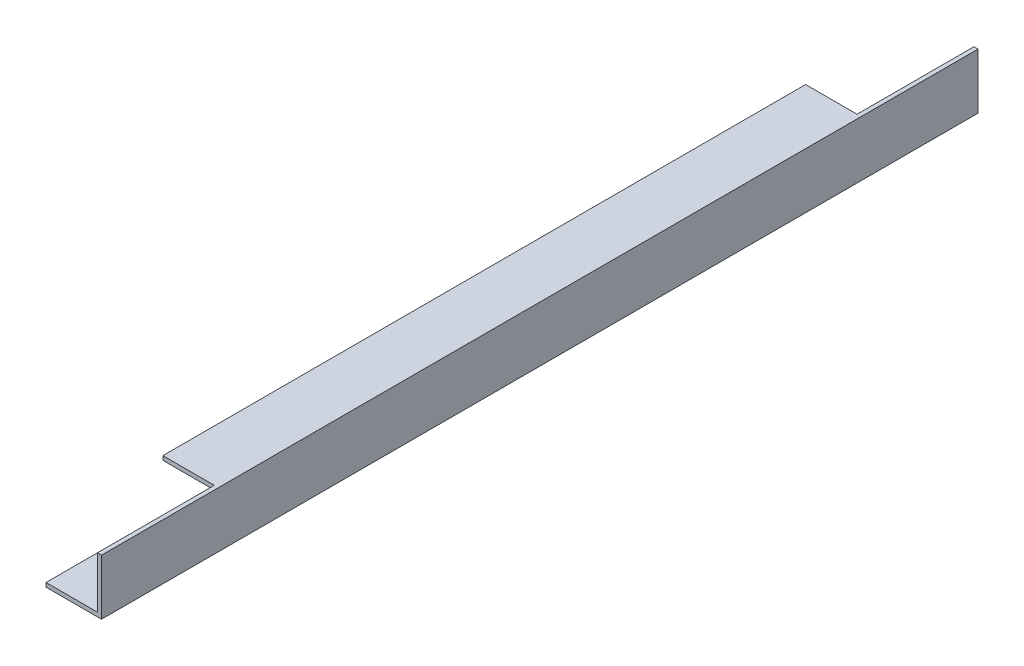
ISO-10303-21;
HEADER;
FILE_DESCRIPTION(('STEP AP214'),'2;1');
FILE_NAME('part.step','',(''),(''),'','','');
FILE_SCHEMA(('AUTOMOTIVE_DESIGN { 1 0 10303 214 1 1 1 1 }'));
ENDSEC;
DATA;
#1=APPLICATION_CONTEXT('core data for automotive mechanical design processes');
#2=APPLICATION_PROTOCOL_DEFINITION('international standard','automotive_design',2000,#1);
#3=PRODUCT_CONTEXT('',#1,'mechanical');
#4=PRODUCT('Part','Part','',(#3));
#5=PRODUCT_RELATED_PRODUCT_CATEGORY('part','',(#4));
#6=PRODUCT_DEFINITION_FORMATION('','',#4);
#7=PRODUCT_DEFINITION_CONTEXT('part definition',#1,'design');
#8=PRODUCT_DEFINITION('design','',#6,#7);
#9=PRODUCT_DEFINITION_SHAPE('','',#8);
#10=(LENGTH_UNIT() NAMED_UNIT(*) SI_UNIT(.MILLI.,.METRE.));
#11=(NAMED_UNIT(*) PLANE_ANGLE_UNIT() SI_UNIT($,.RADIAN.));
#12=(NAMED_UNIT(*) SI_UNIT($,.STERADIAN.) SOLID_ANGLE_UNIT());
#13=UNCERTAINTY_MEASURE_WITH_UNIT(LENGTH_MEASURE(1.E-05),#10,'distance_accuracy_value','');
#14=(GEOMETRIC_REPRESENTATION_CONTEXT(3) GLOBAL_UNCERTAINTY_ASSIGNED_CONTEXT((#13)) GLOBAL_UNIT_ASSIGNED_CONTEXT((#10,
#11,#12)) REPRESENTATION_CONTEXT('',''));
#15=CARTESIAN_POINT('',(0.,0.,0.));
#16=DIRECTION('',(0.,0.,1.));
#17=DIRECTION('',(1.,0.,0.));
#18=AXIS2_PLACEMENT_3D('',#15,#16,#17);
#19=CARTESIAN_POINT('',(4.75,4.75,75.));
#20=DIRECTION('',(0.,-1.,0.));
#21=DIRECTION('',(0.,0.,-1.));
#22=AXIS2_PLACEMENT_3D('',#19,#20,#21);
#23=PLANE('',#22);
#24=DIRECTION('',(0.,0.,1.));
#25=VECTOR('',#24,1.);
#26=CARTESIAN_POINT('',(4.05,4.75,75.));
#27=LINE('',#26,#25);
#28=CARTESIAN_POINT('',(4.05,4.75,55.));
#29=VERTEX_POINT('',#28);
#30=CARTESIAN_POINT('',(4.05,4.75,75.));
#31=VERTEX_POINT('',#30);
#32=EDGE_CURVE('E184',#29,#31,#27,.T.);
#33=ORIENTED_EDGE('',*,*,#32,.T.);
#34=DIRECTION('',(-1.,0.,0.));
#35=VECTOR('',#34,1.);
#36=CARTESIAN_POINT('',(4.75,4.75,75.));
#37=LINE('',#36,#35);
#38=CARTESIAN_POINT('',(4.75,4.75,75.));
#39=VERTEX_POINT('',#38);
#40=EDGE_CURVE('E132',#39,#31,#37,.T.);
#41=ORIENTED_EDGE('',*,*,#40,.F.);
#42=DIRECTION('',(0.,0.,-1.));
#43=VECTOR('',#42,1.);
#44=CARTESIAN_POINT('',(4.75,4.75,75.));
#45=LINE('',#44,#43);
#46=CARTESIAN_POINT('',(4.75,4.75,-75.));
#47=VERTEX_POINT('',#46);
#48=EDGE_CURVE('E117',#39,#47,#45,.T.);
#49=ORIENTED_EDGE('',*,*,#48,.T.);
#50=DIRECTION('',(-1.,0.,0.));
#51=VECTOR('',#50,1.);
#52=CARTESIAN_POINT('',(4.75,4.75,-75.));
#53=LINE('',#52,#51);
#54=CARTESIAN_POINT('',(4.05,4.75,-75.));
#55=VERTEX_POINT('',#54);
#56=EDGE_CURVE('E121',#47,#55,#53,.T.);
#57=ORIENTED_EDGE('',*,*,#56,.T.);
#58=DIRECTION('',(0.,0.,-1.));
#59=VECTOR('',#58,1.);
#60=CARTESIAN_POINT('',(4.05,4.75,-75.));
#61=LINE('',#60,#59);
#62=CARTESIAN_POINT('',(4.05,4.75,-55.));
#63=VERTEX_POINT('',#62);
#64=EDGE_CURVE('E169',#63,#55,#61,.T.);
#65=ORIENTED_EDGE('',*,*,#64,.F.);
#66=DIRECTION('',(1.,0.,0.));
#67=VECTOR('',#66,1.);
#68=CARTESIAN_POINT('',(-4.75,4.75,-55.));
#69=LINE('',#68,#67);
#70=CARTESIAN_POINT('',(-4.75,4.75,-55.));
#71=VERTEX_POINT('',#70);
#72=EDGE_CURVE('E172',#71,#63,#69,.T.);
#73=ORIENTED_EDGE('',*,*,#72,.F.);
#74=DIRECTION('',(0.,0.,-1.));
#75=VECTOR('',#74,1.);
#76=CARTESIAN_POINT('',(-4.75,4.75,75.));
#77=LINE('',#76,#75);
#78=CARTESIAN_POINT('',(-4.75,4.75,55.));
#79=VERTEX_POINT('',#78);
#80=EDGE_CURVE('E11',#79,#71,#77,.T.);
#81=ORIENTED_EDGE('',*,*,#80,.F.);
#82=DIRECTION('',(1.,0.,0.));
#83=VECTOR('',#82,1.);
#84=CARTESIAN_POINT('',(-4.75,4.75,55.));
#85=LINE('',#84,#83);
#86=EDGE_CURVE('E186',#79,#29,#85,.T.);
#87=ORIENTED_EDGE('',*,*,#86,.T.);
#88=EDGE_LOOP('',(#33,#41,#49,#57,#65,#73,#81,#87));
#89=FACE_BOUND('',#88,.T.);
#90=ADVANCED_FACE('F33',(#89),#23,.F.);
#91=CARTESIAN_POINT('',(-4.75,4.75,75.));
#92=DIRECTION('',(1.,0.,0.));
#93=DIRECTION('',(0.,0.,-1.));
#94=AXIS2_PLACEMENT_3D('',#91,#92,#93);
#95=PLANE('',#94);
#96=DIRECTION('',(0.,1.,0.));
#97=VECTOR('',#96,1.);
#98=CARTESIAN_POINT('',(-4.75,-17.8004004539963,55.));
#99=LINE('',#98,#97);
#100=CARTESIAN_POINT('',(-4.75,4.05,55.));
#101=VERTEX_POINT('',#100);
#102=EDGE_CURVE('E194',#101,#79,#99,.T.);
#103=ORIENTED_EDGE('',*,*,#102,.T.);
#104=ORIENTED_EDGE('',*,*,#80,.T.);
#105=DIRECTION('',(0.,1.,0.));
#106=VECTOR('',#105,1.);
#107=CARTESIAN_POINT('',(-4.75,-17.8004004539963,-55.));
#108=LINE('',#107,#106);
#109=CARTESIAN_POINT('',(-4.75,4.05,-55.));
#110=VERTEX_POINT('',#109);
#111=EDGE_CURVE('E162',#110,#71,#108,.T.);
#112=ORIENTED_EDGE('',*,*,#111,.F.);
#113=DIRECTION('',(0.,0.,-1.));
#114=VECTOR('',#113,1.);
#115=CARTESIAN_POINT('',(-4.75,4.05,75.));
#116=LINE('',#115,#114);
#117=EDGE_CURVE('E40',#101,#110,#116,.T.);
#118=ORIENTED_EDGE('',*,*,#117,.F.);
#119=EDGE_LOOP('',(#103,#104,#112,#118));
#120=FACE_BOUND('',#119,.T.);
#121=ADVANCED_FACE('F167',(#120),#95,.F.);
#122=CARTESIAN_POINT('',(4.05,4.05,75.));
#123=DIRECTION('',(0.,1.,0.));
#124=DIRECTION('',(-1.,0.,0.));
#125=AXIS2_PLACEMENT_3D('',#122,#123,#124);
#126=PLANE('',#125);
#127=DIRECTION('',(-1.,0.,0.));
#128=VECTOR('',#127,1.);
#129=CARTESIAN_POINT('',(-4.75,4.05,55.));
#130=LINE('',#129,#128);
#131=CARTESIAN_POINT('',(4.05,4.05,55.));
#132=VERTEX_POINT('',#131);
#133=EDGE_CURVE('E152',#132,#101,#130,.T.);
#134=ORIENTED_EDGE('',*,*,#133,.T.);
#135=ORIENTED_EDGE('',*,*,#117,.T.);
#136=DIRECTION('',(-1.,0.,0.));
#137=VECTOR('',#136,1.);
#138=CARTESIAN_POINT('',(-4.75,4.05,-55.));
#139=LINE('',#138,#137);
#140=CARTESIAN_POINT('',(4.05,4.05,-55.));
#141=VERTEX_POINT('',#140);
#142=EDGE_CURVE('E124',#141,#110,#139,.T.);
#143=ORIENTED_EDGE('',*,*,#142,.F.);
#144=DIRECTION('',(0.,0.,-1.));
#145=VECTOR('',#144,1.);
#146=CARTESIAN_POINT('',(4.05,4.05,75.));
#147=LINE('',#146,#145);
#148=EDGE_CURVE('E139',#132,#141,#147,.T.);
#149=ORIENTED_EDGE('',*,*,#148,.F.);
#150=EDGE_LOOP('',(#134,#135,#143,#149));
#151=FACE_BOUND('',#150,.T.);
#152=ADVANCED_FACE('F147',(#151),#126,.F.);
#153=CARTESIAN_POINT('',(0.,0.,75.));
#154=DIRECTION('',(0.,0.,1.));
#155=DIRECTION('',(1.,0.,0.));
#156=AXIS2_PLACEMENT_3D('',#153,#154,#155);
#157=PLANE('',#156);
#158=ORIENTED_EDGE('',*,*,#40,.T.);
#159=DIRECTION('',(0.,-1.,0.));
#160=VECTOR('',#159,1.);
#161=CARTESIAN_POINT('',(4.05,4.05,75.));
#162=LINE('',#161,#160);
#163=CARTESIAN_POINT('',(4.05,-4.05,75.));
#164=VERTEX_POINT('',#163);
#165=EDGE_CURVE('E86',#31,#164,#162,.T.);
#166=ORIENTED_EDGE('',*,*,#165,.T.);
#167=DIRECTION('',(-1.,0.,0.));
#168=VECTOR('',#167,1.);
#169=CARTESIAN_POINT('',(4.05,-4.05,75.));
#170=LINE('',#169,#168);
#171=CARTESIAN_POINT('',(-4.75,-4.05,75.));
#172=VERTEX_POINT('',#171);
#173=EDGE_CURVE('E100',#164,#172,#170,.T.);
#174=ORIENTED_EDGE('',*,*,#173,.T.);
#175=DIRECTION('',(0.,-1.,0.));
#176=VECTOR('',#175,1.);
#177=CARTESIAN_POINT('',(-4.75,-4.75,75.));
#178=LINE('',#177,#176);
#179=CARTESIAN_POINT('',(-4.75,-4.75,75.));
#180=VERTEX_POINT('',#179);
#181=EDGE_CURVE('E93',#172,#180,#178,.T.);
#182=ORIENTED_EDGE('',*,*,#181,.T.);
#183=DIRECTION('',(1.,0.,0.));
#184=VECTOR('',#183,1.);
#185=CARTESIAN_POINT('',(4.75,-4.75,75.));
#186=LINE('',#185,#184);
#187=CARTESIAN_POINT('',(4.75,-4.75,75.));
#188=VERTEX_POINT('',#187);
#189=EDGE_CURVE('E97',#180,#188,#186,.T.);
#190=ORIENTED_EDGE('',*,*,#189,.T.);
#191=DIRECTION('',(0.,1.,0.));
#192=VECTOR('',#191,1.);
#193=CARTESIAN_POINT('',(4.75,4.75,75.));
#194=LINE('',#193,#192);
#195=EDGE_CURVE('E56',#188,#39,#194,.T.);
#196=ORIENTED_EDGE('',*,*,#195,.T.);
#197=EDGE_LOOP('',(#158,#166,#174,#182,#190,#196));
#198=FACE_BOUND('',#197,.T.);
#199=ADVANCED_FACE('F95',(#198),#157,.T.);
#200=CARTESIAN_POINT('',(4.05,4.05,75.));
#201=DIRECTION('',(1.,0.,0.));
#202=DIRECTION('',(0.,1.,0.));
#203=AXIS2_PLACEMENT_3D('',#200,#201,#202);
#204=PLANE('',#203);
#205=DIRECTION('',(0.,-1.,0.));
#206=VECTOR('',#205,1.);
#207=CARTESIAN_POINT('',(4.05,4.05,-75.));
#208=LINE('',#207,#206);
#209=CARTESIAN_POINT('',(4.05,-4.05,-75.));
#210=VERTEX_POINT('',#209);
#211=EDGE_CURVE('E47',#55,#210,#208,.T.);
#212=ORIENTED_EDGE('',*,*,#211,.T.);
#213=DIRECTION('',(0.,0.,-1.));
#214=VECTOR('',#213,1.);
#215=CARTESIAN_POINT('',(4.05,-4.05,75.));
#216=LINE('',#215,#214);
#217=EDGE_CURVE('E136',#164,#210,#216,.T.);
#218=ORIENTED_EDGE('',*,*,#217,.F.);
#219=ORIENTED_EDGE('',*,*,#165,.F.);
#220=ORIENTED_EDGE('',*,*,#32,.F.);
#221=DIRECTION('',(0.,1.,0.));
#222=VECTOR('',#221,1.);
#223=CARTESIAN_POINT('',(4.05,-17.8004004539963,55.));
#224=LINE('',#223,#222);
#225=EDGE_CURVE('E190',#132,#29,#224,.T.);
#226=ORIENTED_EDGE('',*,*,#225,.F.);
#227=ORIENTED_EDGE('',*,*,#148,.T.);
#228=DIRECTION('',(0.,1.,0.));
#229=VECTOR('',#228,1.);
#230=CARTESIAN_POINT('',(4.05,-17.8004004539963,-55.));
#231=LINE('',#230,#229);
#232=EDGE_CURVE('E165',#141,#63,#231,.T.);
#233=ORIENTED_EDGE('',*,*,#232,.T.);
#234=ORIENTED_EDGE('',*,*,#64,.T.);
#235=EDGE_LOOP('',(#212,#218,#219,#220,#226,#227,#233,#234));
#236=FACE_BOUND('',#235,.T.);
#237=ADVANCED_FACE('F201',(#236),#204,.F.);
#238=CARTESIAN_POINT('',(4.05,-4.05,75.));
#239=DIRECTION('',(0.,-1.,0.));
#240=DIRECTION('',(1.,0.,0.));
#241=AXIS2_PLACEMENT_3D('',#238,#239,#240);
#242=PLANE('',#241);
#243=DIRECTION('',(-1.,0.,0.));
#244=VECTOR('',#243,1.);
#245=CARTESIAN_POINT('',(4.05,-4.05,-75.));
#246=LINE('',#245,#244);
#247=CARTESIAN_POINT('',(-4.75,-4.05,-75.));
#248=VERTEX_POINT('',#247);
#249=EDGE_CURVE('E126',#210,#248,#246,.T.);
#250=ORIENTED_EDGE('',*,*,#249,.T.);
#251=DIRECTION('',(0.,0.,-1.));
#252=VECTOR('',#251,1.);
#253=CARTESIAN_POINT('',(-4.75,-4.05,75.));
#254=LINE('',#253,#252);
#255=EDGE_CURVE('E112',#172,#248,#254,.T.);
#256=ORIENTED_EDGE('',*,*,#255,.F.);
#257=ORIENTED_EDGE('',*,*,#173,.F.);
#258=ORIENTED_EDGE('',*,*,#217,.T.);
#259=EDGE_LOOP('',(#250,#256,#257,#258));
#260=FACE_BOUND('',#259,.T.);
#261=ADVANCED_FACE('F230',(#260),#242,.F.);
#262=CARTESIAN_POINT('',(-4.75,-4.75,75.));
#263=DIRECTION('',(1.,0.,0.));
#264=DIRECTION('',(0.,0.,-1.));
#265=AXIS2_PLACEMENT_3D('',#262,#263,#264);
#266=PLANE('',#265);
#267=DIRECTION('',(0.,-1.,0.));
#268=VECTOR('',#267,1.);
#269=CARTESIAN_POINT('',(-4.75,-4.75,-75.));
#270=LINE('',#269,#268);
#271=CARTESIAN_POINT('',(-4.75,-4.75,-75.));
#272=VERTEX_POINT('',#271);
#273=EDGE_CURVE('E109',#248,#272,#270,.T.);
#274=ORIENTED_EDGE('',*,*,#273,.T.);
#275=DIRECTION('',(0.,0.,-1.));
#276=VECTOR('',#275,1.);
#277=CARTESIAN_POINT('',(-4.75,-4.75,75.));
#278=LINE('',#277,#276);
#279=EDGE_CURVE('E106',#180,#272,#278,.T.);
#280=ORIENTED_EDGE('',*,*,#279,.F.);
#281=ORIENTED_EDGE('',*,*,#181,.F.);
#282=ORIENTED_EDGE('',*,*,#255,.T.);
#283=EDGE_LOOP('',(#274,#280,#281,#282));
#284=FACE_BOUND('',#283,.T.);
#285=ADVANCED_FACE('F107',(#284),#266,.F.);
#286=CARTESIAN_POINT('',(4.75,-4.75,75.));
#287=DIRECTION('',(0.,1.,0.));
#288=DIRECTION('',(-1.,0.,0.));
#289=AXIS2_PLACEMENT_3D('',#286,#287,#288);
#290=PLANE('',#289);
#291=DIRECTION('',(1.,0.,0.));
#292=VECTOR('',#291,1.);
#293=CARTESIAN_POINT('',(4.75,-4.75,-75.));
#294=LINE('',#293,#292);
#295=CARTESIAN_POINT('',(4.75,-4.75,-75.));
#296=VERTEX_POINT('',#295);
#297=EDGE_CURVE('E129',#272,#296,#294,.T.);
#298=ORIENTED_EDGE('',*,*,#297,.T.);
#299=DIRECTION('',(0.,0.,-1.));
#300=VECTOR('',#299,1.);
#301=CARTESIAN_POINT('',(4.75,-4.75,75.));
#302=LINE('',#301,#300);
#303=EDGE_CURVE('E113',#188,#296,#302,.T.);
#304=ORIENTED_EDGE('',*,*,#303,.F.);
#305=ORIENTED_EDGE('',*,*,#189,.F.);
#306=ORIENTED_EDGE('',*,*,#279,.T.);
#307=EDGE_LOOP('',(#298,#304,#305,#306));
#308=FACE_BOUND('',#307,.T.);
#309=ADVANCED_FACE('F115',(#308),#290,.F.);
#310=CARTESIAN_POINT('',(4.75,4.75,75.));
#311=DIRECTION('',(-1.,0.,0.));
#312=DIRECTION('',(0.,-1.,0.));
#313=AXIS2_PLACEMENT_3D('',#310,#311,#312);
#314=PLANE('',#313);
#315=DIRECTION('',(0.,1.,0.));
#316=VECTOR('',#315,1.);
#317=CARTESIAN_POINT('',(4.75,4.75,-75.));
#318=LINE('',#317,#316);
#319=EDGE_CURVE('E79',#296,#47,#318,.T.);
#320=ORIENTED_EDGE('',*,*,#319,.T.);
#321=ORIENTED_EDGE('',*,*,#48,.F.);
#322=ORIENTED_EDGE('',*,*,#195,.F.);
#323=ORIENTED_EDGE('',*,*,#303,.T.);
#324=EDGE_LOOP('',(#320,#321,#322,#323));
#325=FACE_BOUND('',#324,.T.);
#326=ADVANCED_FACE('F238',(#325),#314,.F.);
#327=CARTESIAN_POINT('',(0.,0.,-75.));
#328=DIRECTION('',(0.,0.,1.));
#329=DIRECTION('',(1.,0.,0.));
#330=AXIS2_PLACEMENT_3D('',#327,#328,#329);
#331=PLANE('',#330);
#332=ORIENTED_EDGE('',*,*,#211,.F.);
#333=ORIENTED_EDGE('',*,*,#56,.F.);
#334=ORIENTED_EDGE('',*,*,#319,.F.);
#335=ORIENTED_EDGE('',*,*,#297,.F.);
#336=ORIENTED_EDGE('',*,*,#273,.F.);
#337=ORIENTED_EDGE('',*,*,#249,.F.);
#338=EDGE_LOOP('',(#332,#333,#334,#335,#336,#337));
#339=FACE_BOUND('',#338,.T.);
#340=ADVANCED_FACE('F217',(#339),#331,.F.);
#341=CARTESIAN_POINT('',(-4.75,-17.8004004539963,-55.));
#342=DIRECTION('',(0.,0.,1.));
#343=DIRECTION('',(1.,0.,0.));
#344=AXIS2_PLACEMENT_3D('',#341,#342,#343);
#345=PLANE('',#344);
#346=ORIENTED_EDGE('',*,*,#142,.T.);
#347=ORIENTED_EDGE('',*,*,#111,.T.);
#348=ORIENTED_EDGE('',*,*,#72,.T.);
#349=ORIENTED_EDGE('',*,*,#232,.F.);
#350=EDGE_LOOP('',(#346,#347,#348,#349));
#351=FACE_BOUND('',#350,.T.);
#352=ADVANCED_FACE('F159',(#351),#345,.F.);
#353=CARTESIAN_POINT('',(-4.75,-17.8004004539963,55.));
#354=DIRECTION('',(0.,0.,1.));
#355=DIRECTION('',(1.,0.,0.));
#356=AXIS2_PLACEMENT_3D('',#353,#354,#355);
#357=PLANE('',#356);
#358=ORIENTED_EDGE('',*,*,#225,.T.);
#359=ORIENTED_EDGE('',*,*,#86,.F.);
#360=ORIENTED_EDGE('',*,*,#102,.F.);
#361=ORIENTED_EDGE('',*,*,#133,.F.);
#362=EDGE_LOOP('',(#358,#359,#360,#361));
#363=FACE_BOUND('',#362,.T.);
#364=ADVANCED_FACE('F211',(#363),#357,.T.);
#365=CLOSED_SHELL('',(#90,#121,#152,#199,#237,#261,#285,#309,#326,#340,#352,#364));
#366=MANIFOLD_SOLID_BREP('B2',#365);
#367=ADVANCED_BREP_SHAPE_REPRESENTATION('',(#18,#366),#14);
#368=SHAPE_DEFINITION_REPRESENTATION(#9,#367);
ENDSEC;
END-ISO-10303-21;
